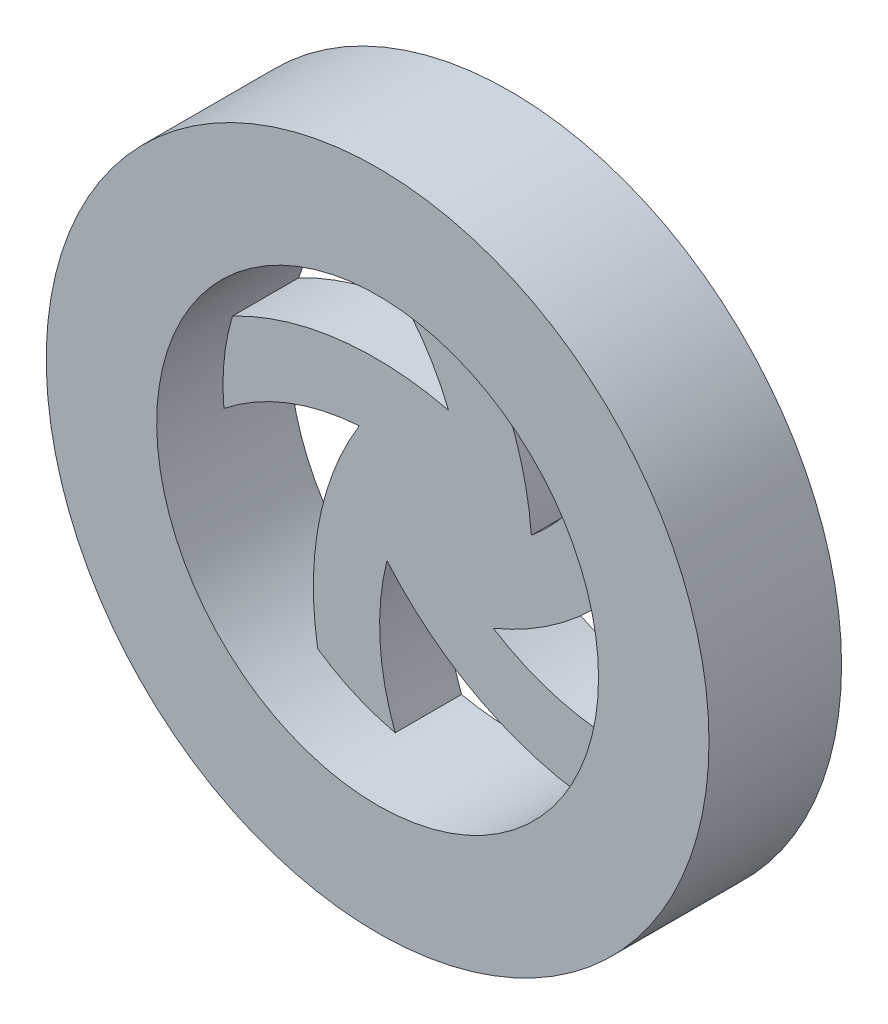
ISO-10303-21;
HEADER;
FILE_DESCRIPTION(('STEP AP214'),'2;1');
FILE_NAME('part.step','',(''),(''),'','','');
FILE_SCHEMA(('AUTOMOTIVE_DESIGN { 1 0 10303 214 1 1 1 1 }'));
ENDSEC;
DATA;
#1=APPLICATION_CONTEXT('core data for automotive mechanical design processes');
#2=APPLICATION_PROTOCOL_DEFINITION('international standard','automotive_design',2000,#1);
#3=PRODUCT_CONTEXT('',#1,'mechanical');
#4=PRODUCT('Part','Part','',(#3));
#5=PRODUCT_RELATED_PRODUCT_CATEGORY('part','',(#4));
#6=PRODUCT_DEFINITION_FORMATION('','',#4);
#7=PRODUCT_DEFINITION_CONTEXT('part definition',#1,'design');
#8=PRODUCT_DEFINITION('design','',#6,#7);
#9=PRODUCT_DEFINITION_SHAPE('','',#8);
#10=(LENGTH_UNIT() NAMED_UNIT(*) SI_UNIT(.MILLI.,.METRE.));
#11=(NAMED_UNIT(*) PLANE_ANGLE_UNIT() SI_UNIT($,.RADIAN.));
#12=(NAMED_UNIT(*) SI_UNIT($,.STERADIAN.) SOLID_ANGLE_UNIT());
#13=UNCERTAINTY_MEASURE_WITH_UNIT(LENGTH_MEASURE(1.E-05),#10,'distance_accuracy_value','');
#14=(GEOMETRIC_REPRESENTATION_CONTEXT(3) GLOBAL_UNCERTAINTY_ASSIGNED_CONTEXT((#13)) GLOBAL_UNIT_ASSIGNED_CONTEXT((#10,
#11,#12)) REPRESENTATION_CONTEXT('',''));
#15=CARTESIAN_POINT('',(0.,0.,0.));
#16=DIRECTION('',(0.,0.,1.));
#17=DIRECTION('',(1.,0.,0.));
#18=AXIS2_PLACEMENT_3D('',#15,#16,#17);
#19=CARTESIAN_POINT('',(0.,0.,30.));
#20=DIRECTION('',(0.,0.,-1.));
#21=DIRECTION('',(-1.,0.,0.));
#22=AXIS2_PLACEMENT_3D('',#19,#20,#21);
#23=CYLINDRICAL_SURFACE('',#22,50.);
#24=DIRECTION('',(0.,0.,-1.));
#25=VECTOR('',#24,1.);
#26=CARTESIAN_POINT('',(-0.999999999999956,49.9899989998,15.));
#27=LINE('',#26,#25);
#28=CARTESIAN_POINT('',(-0.999999999999956,49.9899989998,15.));
#29=VERTEX_POINT('',#28);
#30=CARTESIAN_POINT('',(-0.999999999999956,49.9899989998,0.));
#31=VERTEX_POINT('',#30);
#32=EDGE_CURVE('E209',#29,#31,#27,.T.);
#33=ORIENTED_EDGE('',*,*,#32,.T.);
#34=CARTESIAN_POINT('',(0.,0.,0.));
#35=DIRECTION('',(0.,0.,1.));
#36=DIRECTION('',(1.,0.,0.));
#37=AXIS2_PLACEMENT_3D('',#34,#35,#36);
#38=CIRCLE('',#37,50.);
#39=CARTESIAN_POINT('',(37.5827976312236,32.9777701218638,0.));
#40=VERTEX_POINT('',#39);
#41=EDGE_CURVE('E186',#40,#31,#38,.T.);
#42=ORIENTED_EDGE('',*,*,#41,.F.);
#43=DIRECTION('',(0.,0.,-1.));
#44=VECTOR('',#43,1.);
#45=CARTESIAN_POINT('',(37.5827976312236,32.9777701218638,15.));
#46=LINE('',#45,#44);
#47=CARTESIAN_POINT('',(37.5827976312236,32.9777701218638,15.));
#48=VERTEX_POINT('',#47);
#49=EDGE_CURVE('E176',#48,#40,#46,.T.);
#50=ORIENTED_EDGE('',*,*,#49,.F.);
#51=CARTESIAN_POINT('',(0.,0.,15.));
#52=DIRECTION('',(0.,0.,-1.));
#53=DIRECTION('',(-1.,0.,0.));
#54=AXIS2_PLACEMENT_3D('',#51,#52,#53);
#55=CIRCLE('',#54,50.);
#56=CARTESIAN_POINT('',(47.2342973030285,16.3988157587404,15.));
#57=VERTEX_POINT('',#56);
#58=EDGE_CURVE('E157',#57,#48,#55,.F.);
#59=ORIENTED_EDGE('',*,*,#58,.F.);
#60=DIRECTION('',(0.,0.,-1.));
#61=VECTOR('',#60,1.);
#62=CARTESIAN_POINT('',(47.2342973030285,16.3988157587404,15.));
#63=LINE('',#62,#61);
#64=CARTESIAN_POINT('',(47.2342973030285,16.3988157587404,0.));
#65=VERTEX_POINT('',#64);
#66=EDGE_CURVE('E188',#57,#65,#63,.T.);
#67=ORIENTED_EDGE('',*,*,#66,.T.);
#68=CARTESIAN_POINT('',(42.9774463300559,-25.5526731859342,0.));
#69=VERTEX_POINT('',#68);
#70=EDGE_CURVE('E202',#69,#65,#38,.T.);
#71=ORIENTED_EDGE('',*,*,#70,.F.);
#72=DIRECTION('',(0.,0.,-1.));
#73=VECTOR('',#72,1.);
#74=CARTESIAN_POINT('',(42.9774463300559,-25.5526731859342,15.));
#75=LINE('',#74,#73);
#76=CARTESIAN_POINT('',(42.9774463300559,-25.5526731859342,15.));
#77=VERTEX_POINT('',#76);
#78=EDGE_CURVE('E258',#77,#69,#75,.T.);
#79=ORIENTED_EDGE('',*,*,#78,.F.);
#80=CARTESIAN_POINT('',(30.1924011686396,-39.8549734872817,15.));
#81=VERTEX_POINT('',#80);
#82=EDGE_CURVE('E171',#81,#77,#55,.F.);
#83=ORIENTED_EDGE('',*,*,#82,.F.);
#84=DIRECTION('',(0.,0.,-1.));
#85=VECTOR('',#84,1.);
#86=CARTESIAN_POINT('',(30.1924011686396,-39.8549734872817,15.));
#87=LINE('',#86,#85);
#88=CARTESIAN_POINT('',(30.1924011686396,-39.8549734872817,0.));
#89=VERTEX_POINT('',#88);
#90=EDGE_CURVE('E254',#81,#89,#87,.T.);
#91=ORIENTED_EDGE('',*,*,#90,.T.);
#92=CARTESIAN_POINT('',(-11.0212750515822,-48.7701906520507,0.));
#93=VERTEX_POINT('',#92);
#94=EDGE_CURVE('E204',#93,#89,#38,.T.);
#95=ORIENTED_EDGE('',*,*,#94,.F.);
#96=DIRECTION('',(0.,0.,-1.));
#97=VECTOR('',#96,1.);
#98=CARTESIAN_POINT('',(-11.0212750515822,-48.7701906520507,15.));
#99=LINE('',#98,#97);
#100=CARTESIAN_POINT('',(-11.0212750515822,-48.7701906520507,15.));
#101=VERTEX_POINT('',#100);
#102=EDGE_CURVE('E243',#101,#93,#99,.T.);
#103=ORIENTED_EDGE('',*,*,#102,.F.);
#104=CARTESIAN_POINT('',(-28.5743671798917,-41.0305439918694,15.));
#105=VERTEX_POINT('',#104);
#106=EDGE_CURVE('E237',#105,#101,#55,.F.);
#107=ORIENTED_EDGE('',*,*,#106,.F.);
#108=DIRECTION('',(0.,0.,-1.));
#109=VECTOR('',#108,1.);
#110=CARTESIAN_POINT('',(-28.5743671798917,-41.0305439918694,15.));
#111=LINE('',#110,#109);
#112=CARTESIAN_POINT('',(-28.5743671798917,-41.0305439918694,0.));
#113=VERTEX_POINT('',#112);
#114=EDGE_CURVE('E235',#105,#113,#111,.T.);
#115=ORIENTED_EDGE('',*,*,#114,.T.);
#116=CARTESIAN_POINT('',(-49.7889689114659,-4.58896227191729,0.));
#117=VERTEX_POINT('',#116);
#118=EDGE_CURVE('E208',#117,#113,#38,.T.);
#119=ORIENTED_EDGE('',*,*,#118,.F.);
#120=DIRECTION('',(0.,0.,-1.));
#121=VECTOR('',#120,1.);
#122=CARTESIAN_POINT('',(-49.7889689114659,-4.58896227191729,15.));
#123=LINE('',#122,#121);
#124=CARTESIAN_POINT('',(-49.7889689114659,-4.58896227191729,15.));
#125=VERTEX_POINT('',#124);
#126=EDGE_CURVE('E233',#125,#117,#123,.T.);
#127=ORIENTED_EDGE('',*,*,#126,.F.);
#128=CARTESIAN_POINT('',(-47.852331291888,14.4967027261857,15.));
#129=VERTEX_POINT('',#128);
#130=EDGE_CURVE('E314',#129,#125,#55,.F.);
#131=ORIENTED_EDGE('',*,*,#130,.F.);
#132=DIRECTION('',(0.,0.,-1.));
#133=VECTOR('',#132,1.);
#134=CARTESIAN_POINT('',(-47.852331291888,14.4967027261857,15.));
#135=LINE('',#134,#133);
#136=CARTESIAN_POINT('',(-47.852331291888,14.4967027261857,0.));
#137=VERTEX_POINT('',#136);
#138=EDGE_CURVE('E304',#129,#137,#135,.T.);
#139=ORIENTED_EDGE('',*,*,#138,.T.);
#140=CARTESIAN_POINT('',(-19.750000000434,45.9340559931611,0.));
#141=VERTEX_POINT('',#140);
#142=EDGE_CURVE('E212',#141,#137,#38,.T.);
#143=ORIENTED_EDGE('',*,*,#142,.F.);
#144=DIRECTION('',(0.,0.,-1.));
#145=VECTOR('',#144,1.);
#146=CARTESIAN_POINT('',(-19.750000000434,45.9340559931611,15.));
#147=LINE('',#146,#145);
#148=CARTESIAN_POINT('',(-19.750000000434,45.9340559931611,15.));
#149=VERTEX_POINT('',#148);
#150=EDGE_CURVE('E297',#149,#141,#147,.T.);
#151=ORIENTED_EDGE('',*,*,#150,.F.);
#152=EDGE_CURVE('E170',#29,#149,#55,.F.);
#153=ORIENTED_EDGE('',*,*,#152,.F.);
#154=EDGE_LOOP('',(#33,#42,#50,#59,#67,#71,#79,#83,#91,#95,#103,#107,#115,#119,#127,#131,#139,
#143,#151,#153));
#155=FACE_BOUND('',#154,.T.);
#156=CARTESIAN_POINT('',(0.,0.,30.));
#157=DIRECTION('',(0.,0.,1.));
#158=DIRECTION('',(1.,0.,0.));
#159=AXIS2_PLACEMENT_3D('',#156,#157,#158);
#160=CIRCLE('',#159,50.);
#161=CARTESIAN_POINT('',(50.,0.,30.));
#162=VERTEX_POINT('',#161);
#163=EDGE_CURVE('E198',#162,#162,#160,.T.);
#164=ORIENTED_EDGE('',*,*,#163,.T.);
#165=EDGE_LOOP('',(#164));
#166=FACE_BOUND('',#165,.T.);
#167=ADVANCED_FACE('F45',(#155,#166),#23,.F.);
#168=CARTESIAN_POINT('',(0.,0.,30.));
#169=DIRECTION('',(0.,0.,1.));
#170=DIRECTION('',(1.,0.,0.));
#171=AXIS2_PLACEMENT_3D('',#168,#169,#170);
#172=PLANE('',#171);
#173=CARTESIAN_POINT('',(0.,0.,30.));
#174=DIRECTION('',(0.,0.,1.));
#175=DIRECTION('',(1.,0.,0.));
#176=AXIS2_PLACEMENT_3D('',#173,#174,#175);
#177=CIRCLE('',#176,75.);
#178=CARTESIAN_POINT('',(75.,0.,30.));
#179=VERTEX_POINT('',#178);
#180=EDGE_CURVE('E11',#179,#179,#177,.T.);
#181=ORIENTED_EDGE('',*,*,#180,.T.);
#182=EDGE_LOOP('',(#181));
#183=FACE_BOUND('',#182,.T.);
#184=ORIENTED_EDGE('',*,*,#163,.F.);
#185=EDGE_LOOP('',(#184));
#186=FACE_BOUND('',#185,.T.);
#187=ADVANCED_FACE('F366',(#183,#186),#172,.T.);
#188=CARTESIAN_POINT('',(0.,0.,0.));
#189=DIRECTION('',(0.,0.,1.));
#190=DIRECTION('',(1.,0.,0.));
#191=AXIS2_PLACEMENT_3D('',#188,#189,#190);
#192=PLANE('',#191);
#193=CARTESIAN_POINT('',(-50.,0.,0.));
#194=DIRECTION('',(0.,0.,-1.));
#195=DIRECTION('',(-1.,0.,0.));
#196=AXIS2_PLACEMENT_3D('',#193,#194,#195);
#197=CIRCLE('',#196,54.9999999996055);
#198=CARTESIAN_POINT('',(1.0466459505889,20.4753495001142,0.));
#199=VERTEX_POINT('',#198);
#200=EDGE_CURVE('E289',#141,#199,#197,.T.);
#201=ORIENTED_EDGE('',*,*,#200,.F.);
#202=ORIENTED_EDGE('',*,*,#142,.T.);
#203=CARTESIAN_POINT('',(-15.4508497214862,-47.5528258138678,0.));
#204=DIRECTION('',(0.,0.,-1.));
#205=DIRECTION('',(-1.,0.,0.));
#206=AXIS2_PLACEMENT_3D('',#203,#204,#205);
#207=CIRCLE('',#206,70.);
#208=EDGE_CURVE('E286',#137,#199,#207,.T.);
#209=ORIENTED_EDGE('',*,*,#208,.T.);
#210=EDGE_LOOP('',(#201,#202,#209));
#211=FACE_BOUND('',#210,.T.);
#212=CARTESIAN_POINT('',(-15.4508497214862,47.5528258138678,0.));
#213=DIRECTION('',(0.,0.,-1.));
#214=DIRECTION('',(-1.,0.,0.));
#215=AXIS2_PLACEMENT_3D('',#212,#213,#214);
#216=CIRCLE('',#215,54.9999999996055);
#217=CARTESIAN_POINT('',(19.7966459510229,5.33181151088054,0.));
#218=VERTEX_POINT('',#217);
#219=EDGE_CURVE('E273',#40,#218,#216,.T.);
#220=ORIENTED_EDGE('',*,*,#219,.F.);
#221=ORIENTED_EDGE('',*,*,#41,.T.);
#222=CARTESIAN_POINT('',(-50.,0.,0.));
#223=DIRECTION('',(0.,0.,-1.));
#224=DIRECTION('',(-1.,0.,0.));
#225=AXIS2_PLACEMENT_3D('',#222,#223,#224);
#226=CIRCLE('',#225,70.);
#227=EDGE_CURVE('E181',#31,#218,#226,.T.);
#228=ORIENTED_EDGE('',*,*,#227,.T.);
#229=EDGE_LOOP('',(#220,#221,#228));
#230=FACE_BOUND('',#229,.T.);
#231=CARTESIAN_POINT('',(40.4508497186981,29.3892626146914,0.));
#232=DIRECTION('',(0.,0.,-1.));
#233=DIRECTION('',(-1.,0.,0.));
#234=AXIS2_PLACEMENT_3D('',#231,#232,#233);
#235=CIRCLE('',#234,54.9999999996054);
#236=CARTESIAN_POINT('',(11.1883541101603,-17.1801087651855,0.));
#237=VERTEX_POINT('',#236);
#238=EDGE_CURVE('E61',#69,#237,#235,.T.);
#239=ORIENTED_EDGE('',*,*,#238,.F.);
#240=ORIENTED_EDGE('',*,*,#70,.T.);
#241=CARTESIAN_POINT('',(-15.4508497214862,47.5528258138678,0.));
#242=DIRECTION('',(0.,0.,-1.));
#243=DIRECTION('',(-1.,0.,0.));
#244=AXIS2_PLACEMENT_3D('',#241,#242,#243);
#245=CIRCLE('',#244,70.);
#246=EDGE_CURVE('E264',#65,#237,#245,.T.);
#247=ORIENTED_EDGE('',*,*,#246,.T.);
#248=EDGE_LOOP('',(#239,#240,#247));
#249=FACE_BOUND('',#248,.T.);
#250=CARTESIAN_POINT('',(40.4508497186981,-29.3892626146914,0.));
#251=DIRECTION('',(0.,0.,-1.));
#252=DIRECTION('',(-1.,0.,0.));
#253=AXIS2_PLACEMENT_3D('',#250,#251,#252);
#254=CIRCLE('',#253,54.9999999996055);
#255=CARTESIAN_POINT('',(-12.8818628327784,-15.9497026569332,0.));
#256=VERTEX_POINT('',#255);
#257=EDGE_CURVE('E69',#93,#256,#254,.T.);
#258=ORIENTED_EDGE('',*,*,#257,.F.);
#259=ORIENTED_EDGE('',*,*,#94,.T.);
#260=CARTESIAN_POINT('',(40.4508497186981,29.3892626146914,0.));
#261=DIRECTION('',(0.,0.,-1.));
#262=DIRECTION('',(-1.,0.,0.));
#263=AXIS2_PLACEMENT_3D('',#260,#261,#262);
#264=CIRCLE('',#263,70.);
#265=EDGE_CURVE('E270',#89,#256,#264,.T.);
#266=ORIENTED_EDGE('',*,*,#265,.T.);
#267=EDGE_LOOP('',(#258,#259,#266));
#268=FACE_BOUND('',#267,.T.);
#269=CARTESIAN_POINT('',(0.,0.,0.));
#270=DIRECTION('',(0.,0.,1.));
#271=DIRECTION('',(1.,0.,0.));
#272=AXIS2_PLACEMENT_3D('',#269,#270,#271);
#273=CIRCLE('',#272,75.);
#274=CARTESIAN_POINT('',(75.,0.,0.));
#275=VERTEX_POINT('',#274);
#276=EDGE_CURVE('E49',#275,#275,#273,.T.);
#277=ORIENTED_EDGE('',*,*,#276,.F.);
#278=EDGE_LOOP('',(#277));
#279=FACE_BOUND('',#278,.T.);
#280=ORIENTED_EDGE('',*,*,#118,.T.);
#281=CARTESIAN_POINT('',(40.4508497186981,-29.3892626146914,0.));
#282=DIRECTION('',(0.,0.,-1.));
#283=DIRECTION('',(-1.,0.,0.));
#284=AXIS2_PLACEMENT_3D('',#281,#282,#283);
#285=CIRCLE('',#284,70.);
#286=CARTESIAN_POINT('',(-19.1497831787271,7.32265041400203,0.));
#287=VERTEX_POINT('',#286);
#288=EDGE_CURVE('E226',#113,#287,#285,.T.);
#289=ORIENTED_EDGE('',*,*,#288,.T.);
#290=CARTESIAN_POINT('',(-15.4508497214862,-47.5528258138678,0.));
#291=DIRECTION('',(0.,0.,-1.));
#292=DIRECTION('',(-1.,0.,0.));
#293=AXIS2_PLACEMENT_3D('',#290,#291,#292);
#294=CIRCLE('',#293,54.9999999996054);
#295=EDGE_CURVE('E228',#117,#287,#294,.T.);
#296=ORIENTED_EDGE('',*,*,#295,.F.);
#297=EDGE_LOOP('',(#280,#289,#296));
#298=FACE_BOUND('',#297,.T.);
#299=ADVANCED_FACE('F225',(#211,#230,#249,#268,#279,#298),#192,.F.);
#300=CARTESIAN_POINT('',(0.,0.,30.));
#301=DIRECTION('',(0.,0.,-1.));
#302=DIRECTION('',(-1.,0.,0.));
#303=AXIS2_PLACEMENT_3D('',#300,#301,#302);
#304=CYLINDRICAL_SURFACE('',#303,75.);
#305=ORIENTED_EDGE('',*,*,#180,.F.);
#306=EDGE_LOOP('',(#305));
#307=FACE_BOUND('',#306,.T.);
#308=ORIENTED_EDGE('',*,*,#276,.T.);
#309=EDGE_LOOP('',(#308));
#310=FACE_BOUND('',#309,.T.);
#311=ADVANCED_FACE('F47',(#307,#310),#304,.T.);
#312=CARTESIAN_POINT('',(-15.4508497214862,47.5528258138678,15.));
#313=DIRECTION('',(0.,0.,-1.));
#314=DIRECTION('',(-1.,0.,0.));
#315=AXIS2_PLACEMENT_3D('',#312,#313,#314);
#316=CYLINDRICAL_SURFACE('',#315,54.9999999996055);
#317=ORIENTED_EDGE('',*,*,#219,.T.);
#318=DIRECTION('',(0.,0.,-1.));
#319=VECTOR('',#318,1.);
#320=CARTESIAN_POINT('',(19.7966459510229,5.33181151088054,15.));
#321=LINE('',#320,#319);
#322=CARTESIAN_POINT('',(19.7966459510229,5.33181151088054,15.));
#323=VERTEX_POINT('',#322);
#324=EDGE_CURVE('E178',#323,#218,#321,.T.);
#325=ORIENTED_EDGE('',*,*,#324,.F.);
#326=CARTESIAN_POINT('',(-15.4508497214862,47.5528258138678,15.));
#327=DIRECTION('',(0.,0.,-1.));
#328=DIRECTION('',(-1.,0.,0.));
#329=AXIS2_PLACEMENT_3D('',#326,#327,#328);
#330=CIRCLE('',#329,54.9999999996055);
#331=EDGE_CURVE('E161',#48,#323,#330,.T.);
#332=ORIENTED_EDGE('',*,*,#331,.F.);
#333=ORIENTED_EDGE('',*,*,#49,.T.);
#334=EDGE_LOOP('',(#317,#325,#332,#333));
#335=FACE_BOUND('',#334,.T.);
#336=ADVANCED_FACE('F175',(#335),#316,.F.);
#337=CARTESIAN_POINT('',(-50.,0.,15.));
#338=DIRECTION('',(0.,0.,-1.));
#339=DIRECTION('',(-1.,0.,0.));
#340=AXIS2_PLACEMENT_3D('',#337,#338,#339);
#341=CYLINDRICAL_SURFACE('',#340,70.);
#342=ORIENTED_EDGE('',*,*,#227,.F.);
#343=ORIENTED_EDGE('',*,*,#32,.F.);
#344=CARTESIAN_POINT('',(-50.,0.,15.));
#345=DIRECTION('',(0.,0.,-1.));
#346=DIRECTION('',(-1.,0.,0.));
#347=AXIS2_PLACEMENT_3D('',#344,#345,#346);
#348=CIRCLE('',#347,70.);
#349=EDGE_CURVE('E189',#29,#323,#348,.T.);
#350=ORIENTED_EDGE('',*,*,#349,.T.);
#351=ORIENTED_EDGE('',*,*,#324,.T.);
#352=EDGE_LOOP('',(#342,#343,#350,#351));
#353=FACE_BOUND('',#352,.T.);
#354=ADVANCED_FACE('F382',(#353),#341,.T.);
#355=CARTESIAN_POINT('',(-50.,0.,15.));
#356=DIRECTION('',(0.,0.,-1.));
#357=DIRECTION('',(-1.,0.,0.));
#358=AXIS2_PLACEMENT_3D('',#355,#356,#357);
#359=CYLINDRICAL_SURFACE('',#358,54.9999999996055);
#360=ORIENTED_EDGE('',*,*,#200,.T.);
#361=DIRECTION('',(0.,0.,-1.));
#362=VECTOR('',#361,1.);
#363=CARTESIAN_POINT('',(1.0466459505889,20.4753495001142,15.));
#364=LINE('',#363,#362);
#365=CARTESIAN_POINT('',(1.0466459505889,20.4753495001142,15.));
#366=VERTEX_POINT('',#365);
#367=EDGE_CURVE('E301',#366,#199,#364,.T.);
#368=ORIENTED_EDGE('',*,*,#367,.F.);
#369=CARTESIAN_POINT('',(-50.,0.,15.));
#370=DIRECTION('',(0.,0.,-1.));
#371=DIRECTION('',(-1.,0.,0.));
#372=AXIS2_PLACEMENT_3D('',#369,#370,#371);
#373=CIRCLE('',#372,54.9999999996055);
#374=EDGE_CURVE('E326',#149,#366,#373,.T.);
#375=ORIENTED_EDGE('',*,*,#374,.F.);
#376=ORIENTED_EDGE('',*,*,#150,.T.);
#377=EDGE_LOOP('',(#360,#368,#375,#376));
#378=FACE_BOUND('',#377,.T.);
#379=ADVANCED_FACE('F385',(#378),#359,.F.);
#380=CARTESIAN_POINT('',(-15.4508497214862,-47.5528258138678,15.));
#381=DIRECTION('',(0.,0.,-1.));
#382=DIRECTION('',(-1.,0.,0.));
#383=AXIS2_PLACEMENT_3D('',#380,#381,#382);
#384=CYLINDRICAL_SURFACE('',#383,70.);
#385=ORIENTED_EDGE('',*,*,#208,.F.);
#386=ORIENTED_EDGE('',*,*,#138,.F.);
#387=CARTESIAN_POINT('',(-15.4508497214862,-47.5528258138678,15.));
#388=DIRECTION('',(0.,0.,-1.));
#389=DIRECTION('',(-1.,0.,0.));
#390=AXIS2_PLACEMENT_3D('',#387,#388,#389);
#391=CIRCLE('',#390,70.);
#392=EDGE_CURVE('E319',#129,#366,#391,.T.);
#393=ORIENTED_EDGE('',*,*,#392,.T.);
#394=ORIENTED_EDGE('',*,*,#367,.T.);
#395=EDGE_LOOP('',(#385,#386,#393,#394));
#396=FACE_BOUND('',#395,.T.);
#397=ADVANCED_FACE('F387',(#396),#384,.T.);
#398=CARTESIAN_POINT('',(-15.4508497214862,-47.5528258138678,15.));
#399=DIRECTION('',(0.,0.,-1.));
#400=DIRECTION('',(-1.,0.,0.));
#401=AXIS2_PLACEMENT_3D('',#398,#399,#400);
#402=CYLINDRICAL_SURFACE('',#401,54.9999999996054);
#403=ORIENTED_EDGE('',*,*,#295,.T.);
#404=DIRECTION('',(0.,0.,-1.));
#405=VECTOR('',#404,1.);
#406=CARTESIAN_POINT('',(-19.1497831787271,7.32265041400203,15.));
#407=LINE('',#406,#405);
#408=CARTESIAN_POINT('',(-19.1497831787271,7.32265041400203,15.));
#409=VERTEX_POINT('',#408);
#410=EDGE_CURVE('E242',#409,#287,#407,.T.);
#411=ORIENTED_EDGE('',*,*,#410,.F.);
#412=CARTESIAN_POINT('',(-15.4508497214862,-47.5528258138678,15.));
#413=DIRECTION('',(0.,0.,-1.));
#414=DIRECTION('',(-1.,0.,0.));
#415=AXIS2_PLACEMENT_3D('',#412,#413,#414);
#416=CIRCLE('',#415,54.9999999996054);
#417=EDGE_CURVE('E312',#125,#409,#416,.T.);
#418=ORIENTED_EDGE('',*,*,#417,.F.);
#419=ORIENTED_EDGE('',*,*,#126,.T.);
#420=EDGE_LOOP('',(#403,#411,#418,#419));
#421=FACE_BOUND('',#420,.T.);
#422=ADVANCED_FACE('F310',(#421),#402,.F.);
#423=CARTESIAN_POINT('',(40.4508497186981,-29.3892626146914,15.));
#424=DIRECTION('',(0.,0.,-1.));
#425=DIRECTION('',(-1.,0.,0.));
#426=AXIS2_PLACEMENT_3D('',#423,#424,#425);
#427=CYLINDRICAL_SURFACE('',#426,70.);
#428=ORIENTED_EDGE('',*,*,#288,.F.);
#429=ORIENTED_EDGE('',*,*,#114,.F.);
#430=CARTESIAN_POINT('',(40.4508497186981,-29.3892626146914,15.));
#431=DIRECTION('',(0.,0.,-1.));
#432=DIRECTION('',(-1.,0.,0.));
#433=AXIS2_PLACEMENT_3D('',#430,#431,#432);
#434=CIRCLE('',#433,70.);
#435=EDGE_CURVE('E315',#105,#409,#434,.T.);
#436=ORIENTED_EDGE('',*,*,#435,.T.);
#437=ORIENTED_EDGE('',*,*,#410,.T.);
#438=EDGE_LOOP('',(#428,#429,#436,#437));
#439=FACE_BOUND('',#438,.T.);
#440=ADVANCED_FACE('F357',(#439),#427,.T.);
#441=CARTESIAN_POINT('',(40.4508497186981,-29.3892626146914,15.));
#442=DIRECTION('',(0.,0.,-1.));
#443=DIRECTION('',(-1.,0.,0.));
#444=AXIS2_PLACEMENT_3D('',#441,#442,#443);
#445=CYLINDRICAL_SURFACE('',#444,54.9999999996055);
#446=ORIENTED_EDGE('',*,*,#257,.T.);
#447=DIRECTION('',(0.,0.,-1.));
#448=VECTOR('',#447,1.);
#449=CARTESIAN_POINT('',(-12.8818628327784,-15.9497026569332,15.));
#450=LINE('',#449,#448);
#451=CARTESIAN_POINT('',(-12.8818628327784,-15.9497026569332,15.));
#452=VERTEX_POINT('',#451);
#453=EDGE_CURVE('E248',#452,#256,#450,.T.);
#454=ORIENTED_EDGE('',*,*,#453,.F.);
#455=CARTESIAN_POINT('',(40.4508497186981,-29.3892626146914,15.));
#456=DIRECTION('',(0.,0.,-1.));
#457=DIRECTION('',(-1.,0.,0.));
#458=AXIS2_PLACEMENT_3D('',#455,#456,#457);
#459=CIRCLE('',#458,54.9999999996055);
#460=EDGE_CURVE('E342',#101,#452,#459,.T.);
#461=ORIENTED_EDGE('',*,*,#460,.F.);
#462=ORIENTED_EDGE('',*,*,#102,.T.);
#463=EDGE_LOOP('',(#446,#454,#461,#462));
#464=FACE_BOUND('',#463,.T.);
#465=ADVANCED_FACE('F355',(#464),#445,.F.);
#466=CARTESIAN_POINT('',(40.4508497186981,29.3892626146914,15.));
#467=DIRECTION('',(0.,0.,-1.));
#468=DIRECTION('',(-1.,0.,0.));
#469=AXIS2_PLACEMENT_3D('',#466,#467,#468);
#470=CYLINDRICAL_SURFACE('',#469,70.);
#471=ORIENTED_EDGE('',*,*,#265,.F.);
#472=ORIENTED_EDGE('',*,*,#90,.F.);
#473=CARTESIAN_POINT('',(40.4508497186981,29.3892626146914,15.));
#474=DIRECTION('',(0.,0.,-1.));
#475=DIRECTION('',(-1.,0.,0.));
#476=AXIS2_PLACEMENT_3D('',#473,#474,#475);
#477=CIRCLE('',#476,70.);
#478=EDGE_CURVE('E339',#81,#452,#477,.T.);
#479=ORIENTED_EDGE('',*,*,#478,.T.);
#480=ORIENTED_EDGE('',*,*,#453,.T.);
#481=EDGE_LOOP('',(#471,#472,#479,#480));
#482=FACE_BOUND('',#481,.T.);
#483=ADVANCED_FACE('F353',(#482),#470,.T.);
#484=CARTESIAN_POINT('',(40.4508497186981,29.3892626146914,15.));
#485=DIRECTION('',(0.,0.,-1.));
#486=DIRECTION('',(-1.,0.,0.));
#487=AXIS2_PLACEMENT_3D('',#484,#485,#486);
#488=CYLINDRICAL_SURFACE('',#487,54.9999999996054);
#489=ORIENTED_EDGE('',*,*,#238,.T.);
#490=DIRECTION('',(0.,0.,-1.));
#491=VECTOR('',#490,1.);
#492=CARTESIAN_POINT('',(11.1883541101603,-17.1801087651855,15.));
#493=LINE('',#492,#491);
#494=CARTESIAN_POINT('',(11.1883541101603,-17.1801087651855,15.));
#495=VERTEX_POINT('',#494);
#496=EDGE_CURVE('E193',#495,#237,#493,.T.);
#497=ORIENTED_EDGE('',*,*,#496,.F.);
#498=CARTESIAN_POINT('',(40.4508497186981,29.3892626146914,15.));
#499=DIRECTION('',(0.,0.,-1.));
#500=DIRECTION('',(-1.,0.,0.));
#501=AXIS2_PLACEMENT_3D('',#498,#499,#500);
#502=CIRCLE('',#501,54.9999999996054);
#503=EDGE_CURVE('E336',#77,#495,#502,.T.);
#504=ORIENTED_EDGE('',*,*,#503,.F.);
#505=ORIENTED_EDGE('',*,*,#78,.T.);
#506=EDGE_LOOP('',(#489,#497,#504,#505));
#507=FACE_BOUND('',#506,.T.);
#508=ADVANCED_FACE('F267',(#507),#488,.F.);
#509=CARTESIAN_POINT('',(-15.4508497214862,47.5528258138678,15.));
#510=DIRECTION('',(0.,0.,-1.));
#511=DIRECTION('',(-1.,0.,0.));
#512=AXIS2_PLACEMENT_3D('',#509,#510,#511);
#513=CYLINDRICAL_SURFACE('',#512,70.);
#514=ORIENTED_EDGE('',*,*,#246,.F.);
#515=ORIENTED_EDGE('',*,*,#66,.F.);
#516=CARTESIAN_POINT('',(-15.4508497214862,47.5528258138678,15.));
#517=DIRECTION('',(0.,0.,-1.));
#518=DIRECTION('',(-1.,0.,0.));
#519=AXIS2_PLACEMENT_3D('',#516,#517,#518);
#520=CIRCLE('',#519,70.);
#521=EDGE_CURVE('E164',#57,#495,#520,.T.);
#522=ORIENTED_EDGE('',*,*,#521,.T.);
#523=ORIENTED_EDGE('',*,*,#496,.T.);
#524=EDGE_LOOP('',(#514,#515,#522,#523));
#525=FACE_BOUND('',#524,.T.);
#526=ADVANCED_FACE('F263',(#525),#513,.T.);
#527=CARTESIAN_POINT('',(0.,0.,15.));
#528=DIRECTION('',(0.,0.,-1.));
#529=DIRECTION('',(-1.,0.,0.));
#530=AXIS2_PLACEMENT_3D('',#527,#528,#529);
#531=PLANE('',#530);
#532=ORIENTED_EDGE('',*,*,#331,.T.);
#533=ORIENTED_EDGE('',*,*,#349,.F.);
#534=ORIENTED_EDGE('',*,*,#152,.T.);
#535=ORIENTED_EDGE('',*,*,#374,.T.);
#536=ORIENTED_EDGE('',*,*,#392,.F.);
#537=ORIENTED_EDGE('',*,*,#130,.T.);
#538=ORIENTED_EDGE('',*,*,#417,.T.);
#539=ORIENTED_EDGE('',*,*,#435,.F.);
#540=ORIENTED_EDGE('',*,*,#106,.T.);
#541=ORIENTED_EDGE('',*,*,#460,.T.);
#542=ORIENTED_EDGE('',*,*,#478,.F.);
#543=ORIENTED_EDGE('',*,*,#82,.T.);
#544=ORIENTED_EDGE('',*,*,#503,.T.);
#545=ORIENTED_EDGE('',*,*,#521,.F.);
#546=ORIENTED_EDGE('',*,*,#58,.T.);
#547=EDGE_LOOP('',(#532,#533,#534,#535,#536,#537,#538,#539,#540,#541,#542,#543,#544,#545,#546));
#548=FACE_BOUND('',#547,.T.);
#549=ADVANCED_FACE('F159',(#548),#531,.F.);
#550=CLOSED_SHELL('',(#167,#187,#299,#311,#336,#354,#379,#397,#422,#440,#465,#483,#508,#526,#549));
#551=MANIFOLD_SOLID_BREP('B2',#550);
#552=ADVANCED_BREP_SHAPE_REPRESENTATION('',(#18,#551),#14);
#553=SHAPE_DEFINITION_REPRESENTATION(#9,#552);
ENDSEC;
END-ISO-10303-21;
